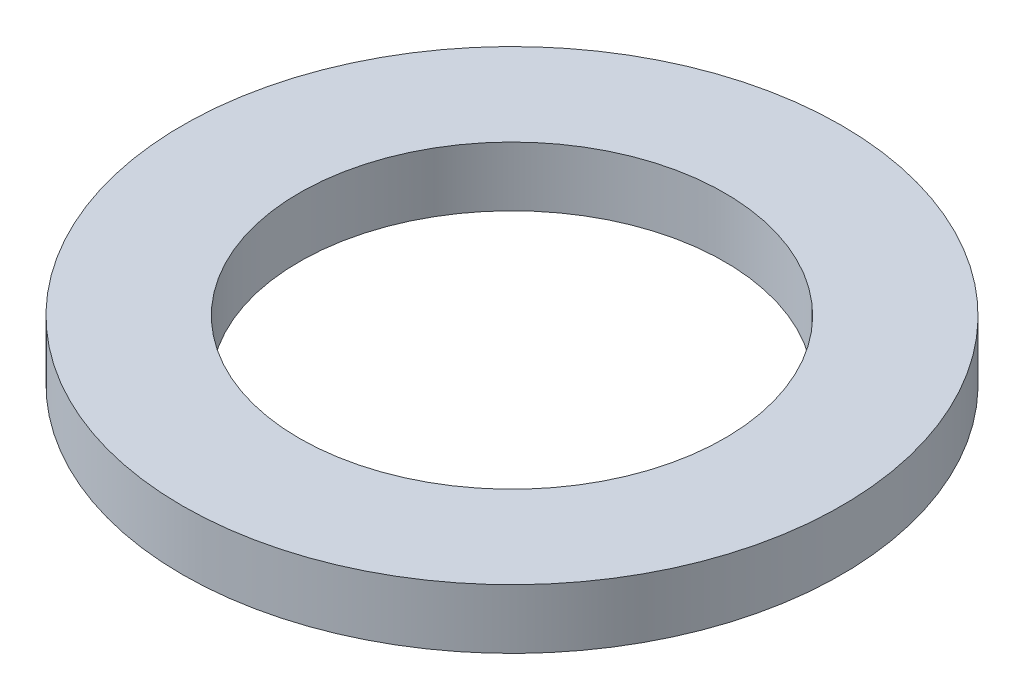
ISO-10303-21;
HEADER;
FILE_DESCRIPTION(('STEP AP214'),'2;1');
FILE_NAME('part.step','',(''),(''),'','','');
FILE_SCHEMA(('AUTOMOTIVE_DESIGN { 1 0 10303 214 1 1 1 1 }'));
ENDSEC;
DATA;
#1=APPLICATION_CONTEXT('core data for automotive mechanical design processes');
#2=APPLICATION_PROTOCOL_DEFINITION('international standard','automotive_design',2000,#1);
#3=PRODUCT_CONTEXT('',#1,'mechanical');
#4=PRODUCT('Part','Part','',(#3));
#5=PRODUCT_RELATED_PRODUCT_CATEGORY('part','',(#4));
#6=PRODUCT_DEFINITION_FORMATION('','',#4);
#7=PRODUCT_DEFINITION_CONTEXT('part definition',#1,'design');
#8=PRODUCT_DEFINITION('design','',#6,#7);
#9=PRODUCT_DEFINITION_SHAPE('','',#8);
#10=(LENGTH_UNIT() NAMED_UNIT(*) SI_UNIT(.MILLI.,.METRE.));
#11=(NAMED_UNIT(*) PLANE_ANGLE_UNIT() SI_UNIT($,.RADIAN.));
#12=(NAMED_UNIT(*) SI_UNIT($,.STERADIAN.) SOLID_ANGLE_UNIT());
#13=UNCERTAINTY_MEASURE_WITH_UNIT(LENGTH_MEASURE(1.E-05),#10,'distance_accuracy_value','');
#14=(GEOMETRIC_REPRESENTATION_CONTEXT(3) GLOBAL_UNCERTAINTY_ASSIGNED_CONTEXT((#13)) GLOBAL_UNIT_ASSIGNED_CONTEXT((#10,
#11,#12)) REPRESENTATION_CONTEXT('',''));
#15=CARTESIAN_POINT('',(0.,0.,0.));
#16=DIRECTION('',(0.,0.,1.));
#17=DIRECTION('',(1.,0.,0.));
#18=AXIS2_PLACEMENT_3D('',#15,#16,#17);
#19=CARTESIAN_POINT('',(0.,14.,0.));
#20=DIRECTION('',(0.,-1.,0.));
#21=DIRECTION('',(0.,0.,-1.));
#22=AXIS2_PLACEMENT_3D('',#19,#20,#21);
#23=CYLINDRICAL_SURFACE('',#22,77.5);
#24=CARTESIAN_POINT('',(0.,14.,0.));
#25=DIRECTION('',(0.,1.,0.));
#26=DIRECTION('',(0.,0.,1.));
#27=AXIS2_PLACEMENT_3D('',#24,#25,#26);
#28=CIRCLE('',#27,77.5);
#29=CARTESIAN_POINT('',(0.,14.,77.5));
#30=VERTEX_POINT('',#29);
#31=EDGE_CURVE('E10',#30,#30,#28,.T.);
#32=ORIENTED_EDGE('',*,*,#31,.F.);
#33=EDGE_LOOP('',(#32));
#34=FACE_BOUND('',#33,.T.);
#35=CARTESIAN_POINT('',(0.,0.,0.));
#36=DIRECTION('',(0.,1.,0.));
#37=DIRECTION('',(0.,0.,1.));
#38=AXIS2_PLACEMENT_3D('',#35,#36,#37);
#39=CIRCLE('',#38,77.5);
#40=CARTESIAN_POINT('',(0.,0.,77.5));
#41=VERTEX_POINT('',#40);
#42=EDGE_CURVE('E37',#41,#41,#39,.T.);
#43=ORIENTED_EDGE('',*,*,#42,.T.);
#44=EDGE_LOOP('',(#43));
#45=FACE_BOUND('',#44,.T.);
#46=ADVANCED_FACE('F40',(#34,#45),#23,.T.);
#47=CARTESIAN_POINT('',(0.,14.,0.));
#48=DIRECTION('',(0.,1.,0.));
#49=DIRECTION('',(0.,0.,1.));
#50=AXIS2_PLACEMENT_3D('',#47,#48,#49);
#51=PLANE('',#50);
#52=CARTESIAN_POINT('',(0.,14.,0.));
#53=DIRECTION('',(0.,1.,0.));
#54=DIRECTION('',(0.,0.,1.));
#55=AXIS2_PLACEMENT_3D('',#52,#53,#54);
#56=CIRCLE('',#55,50.);
#57=CARTESIAN_POINT('',(0.,14.,50.));
#58=VERTEX_POINT('',#57);
#59=EDGE_CURVE('E50',#58,#58,#56,.T.);
#60=ORIENTED_EDGE('',*,*,#59,.F.);
#61=EDGE_LOOP('',(#60));
#62=FACE_BOUND('',#61,.T.);
#63=ORIENTED_EDGE('',*,*,#31,.T.);
#64=EDGE_LOOP('',(#63));
#65=FACE_BOUND('',#64,.T.);
#66=ADVANCED_FACE('F59',(#62,#65),#51,.T.);
#67=CARTESIAN_POINT('',(0.,0.,0.));
#68=DIRECTION('',(0.,1.,0.));
#69=DIRECTION('',(0.,0.,1.));
#70=AXIS2_PLACEMENT_3D('',#67,#68,#69);
#71=PLANE('',#70);
#72=CARTESIAN_POINT('',(0.,0.,0.));
#73=DIRECTION('',(0.,1.,0.));
#74=DIRECTION('',(0.,0.,1.));
#75=AXIS2_PLACEMENT_3D('',#72,#73,#74);
#76=CIRCLE('',#75,50.);
#77=CARTESIAN_POINT('',(0.,0.,50.));
#78=VERTEX_POINT('',#77);
#79=EDGE_CURVE('E47',#78,#78,#76,.T.);
#80=ORIENTED_EDGE('',*,*,#79,.T.);
#81=EDGE_LOOP('',(#80));
#82=FACE_BOUND('',#81,.T.);
#83=ORIENTED_EDGE('',*,*,#42,.F.);
#84=EDGE_LOOP('',(#83));
#85=FACE_BOUND('',#84,.T.);
#86=ADVANCED_FACE('F58',(#82,#85),#71,.F.);
#87=CARTESIAN_POINT('',(0.,14.,0.));
#88=DIRECTION('',(0.,-1.,0.));
#89=DIRECTION('',(0.,0.,-1.));
#90=AXIS2_PLACEMENT_3D('',#87,#88,#89);
#91=CYLINDRICAL_SURFACE('',#90,50.);
#92=ORIENTED_EDGE('',*,*,#59,.T.);
#93=EDGE_LOOP('',(#92));
#94=FACE_BOUND('',#93,.T.);
#95=ORIENTED_EDGE('',*,*,#79,.F.);
#96=EDGE_LOOP('',(#95));
#97=FACE_BOUND('',#96,.T.);
#98=ADVANCED_FACE('F54',(#94,#97),#91,.F.);
#99=CLOSED_SHELL('',(#46,#66,#86,#98));
#100=MANIFOLD_SOLID_BREP('B2',#99);
#101=ADVANCED_BREP_SHAPE_REPRESENTATION('',(#18,#100),#14);
#102=SHAPE_DEFINITION_REPRESENTATION(#9,#101);
ENDSEC;
END-ISO-10303-21;
